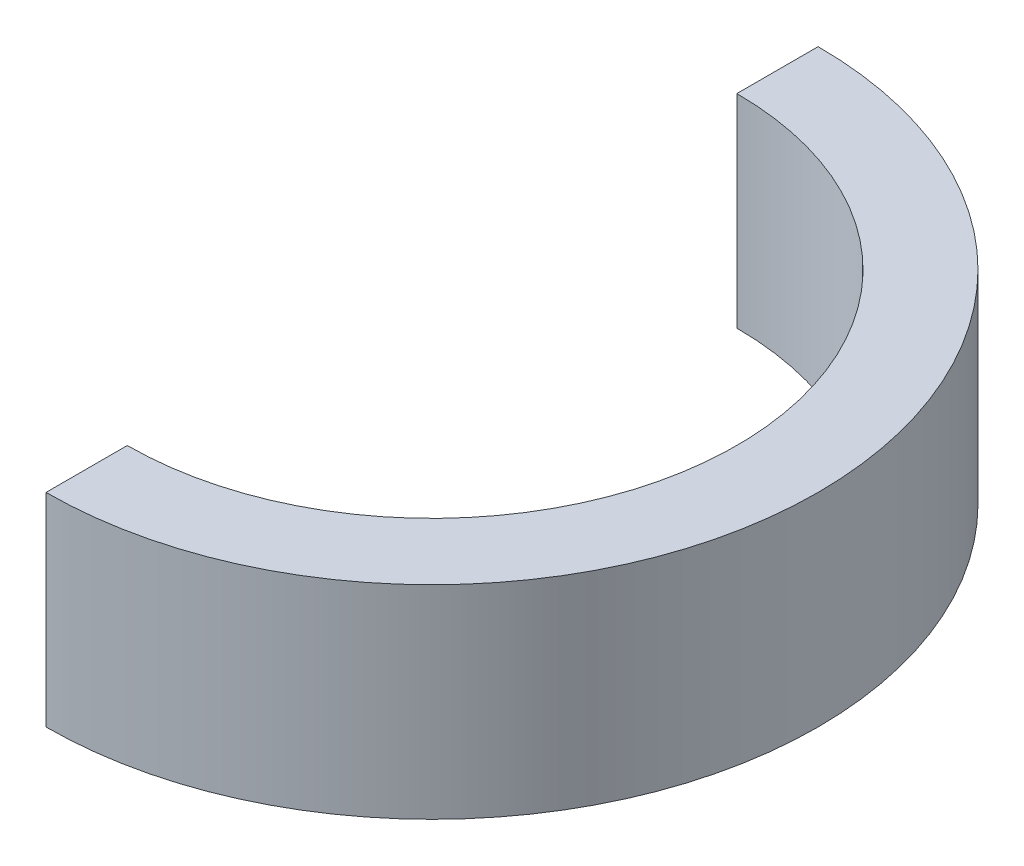
ISO-10303-21;
HEADER;
FILE_DESCRIPTION(('STEP AP214'),'2;1');
FILE_NAME('part.step','',(''),(''),'','','');
FILE_SCHEMA(('AUTOMOTIVE_DESIGN { 1 0 10303 214 1 1 1 1 }'));
ENDSEC;
DATA;
#1=APPLICATION_CONTEXT('core data for automotive mechanical design processes');
#2=APPLICATION_PROTOCOL_DEFINITION('international standard','automotive_design',2000,#1);
#3=PRODUCT_CONTEXT('',#1,'mechanical');
#4=PRODUCT('Part','Part','',(#3));
#5=PRODUCT_RELATED_PRODUCT_CATEGORY('part','',(#4));
#6=PRODUCT_DEFINITION_FORMATION('','',#4);
#7=PRODUCT_DEFINITION_CONTEXT('part definition',#1,'design');
#8=PRODUCT_DEFINITION('design','',#6,#7);
#9=PRODUCT_DEFINITION_SHAPE('','',#8);
#10=(LENGTH_UNIT() NAMED_UNIT(*) SI_UNIT(.MILLI.,.METRE.));
#11=(NAMED_UNIT(*) PLANE_ANGLE_UNIT() SI_UNIT($,.RADIAN.));
#12=(NAMED_UNIT(*) SI_UNIT($,.STERADIAN.) SOLID_ANGLE_UNIT());
#13=UNCERTAINTY_MEASURE_WITH_UNIT(LENGTH_MEASURE(1.E-05),#10,'distance_accuracy_value','');
#14=(GEOMETRIC_REPRESENTATION_CONTEXT(3) GLOBAL_UNCERTAINTY_ASSIGNED_CONTEXT((#13)) GLOBAL_UNIT_ASSIGNED_CONTEXT((#10,
#11,#12)) REPRESENTATION_CONTEXT('',''));
#15=CARTESIAN_POINT('',(0.,0.,0.));
#16=DIRECTION('',(0.,0.,1.));
#17=DIRECTION('',(1.,0.,0.));
#18=AXIS2_PLACEMENT_3D('',#15,#16,#17);
#19=CARTESIAN_POINT('',(0.,20.,0.));
#20=DIRECTION('',(0.,-1.,0.));
#21=DIRECTION('',(0.,0.,-1.));
#22=AXIS2_PLACEMENT_3D('',#19,#20,#21);
#23=CYLINDRICAL_SURFACE('',#22,30.);
#24=CARTESIAN_POINT('',(0.,0.,0.));
#25=DIRECTION('',(0.,-1.,0.));
#26=DIRECTION('',(0.,0.,1.));
#27=AXIS2_PLACEMENT_3D('',#24,#25,#26);
#28=CIRCLE('',#27,30.);
#29=CARTESIAN_POINT('',(0.,0.,-30.));
#30=VERTEX_POINT('',#29);
#31=CARTESIAN_POINT('',(0.,0.,30.));
#32=VERTEX_POINT('',#31);
#33=EDGE_CURVE('E101',#30,#32,#28,.T.);
#34=ORIENTED_EDGE('',*,*,#33,.T.);
#35=DIRECTION('',(0.,-1.,0.));
#36=VECTOR('',#35,1.);
#37=CARTESIAN_POINT('',(0.,20.,30.));
#38=LINE('',#37,#36);
#39=CARTESIAN_POINT('',(0.,20.,30.));
#40=VERTEX_POINT('',#39);
#41=EDGE_CURVE('E11',#40,#32,#38,.T.);
#42=ORIENTED_EDGE('',*,*,#41,.F.);
#43=CARTESIAN_POINT('',(0.,20.,0.));
#44=DIRECTION('',(0.,-1.,0.));
#45=DIRECTION('',(0.,0.,1.));
#46=AXIS2_PLACEMENT_3D('',#43,#44,#45);
#47=CIRCLE('',#46,30.);
#48=CARTESIAN_POINT('',(0.,20.,-30.));
#49=VERTEX_POINT('',#48);
#50=EDGE_CURVE('E89',#49,#40,#47,.T.);
#51=ORIENTED_EDGE('',*,*,#50,.F.);
#52=DIRECTION('',(0.,-1.,0.));
#53=VECTOR('',#52,1.);
#54=CARTESIAN_POINT('',(0.,20.,-30.));
#55=LINE('',#54,#53);
#56=EDGE_CURVE('E97',#49,#30,#55,.T.);
#57=ORIENTED_EDGE('',*,*,#56,.T.);
#58=EDGE_LOOP('',(#34,#42,#51,#57));
#59=FACE_BOUND('',#58,.T.);
#60=ADVANCED_FACE('F38',(#59),#23,.F.);
#61=CARTESIAN_POINT('',(0.,20.,30.));
#62=DIRECTION('',(1.,0.,0.));
#63=DIRECTION('',(0.,0.,-1.));
#64=AXIS2_PLACEMENT_3D('',#61,#62,#63);
#65=PLANE('',#64);
#66=DIRECTION('',(0.,0.,1.));
#67=VECTOR('',#66,1.);
#68=CARTESIAN_POINT('',(0.,0.,30.));
#69=LINE('',#68,#67);
#70=CARTESIAN_POINT('',(0.,0.,38.));
#71=VERTEX_POINT('',#70);
#72=EDGE_CURVE('E93',#32,#71,#69,.T.);
#73=ORIENTED_EDGE('',*,*,#72,.T.);
#74=DIRECTION('',(0.,-1.,0.));
#75=VECTOR('',#74,1.);
#76=CARTESIAN_POINT('',(0.,20.,38.));
#77=LINE('',#76,#75);
#78=CARTESIAN_POINT('',(0.,20.,38.));
#79=VERTEX_POINT('',#78);
#80=EDGE_CURVE('E46',#79,#71,#77,.T.);
#81=ORIENTED_EDGE('',*,*,#80,.F.);
#82=DIRECTION('',(0.,0.,1.));
#83=VECTOR('',#82,1.);
#84=CARTESIAN_POINT('',(0.,20.,30.));
#85=LINE('',#84,#83);
#86=EDGE_CURVE('E84',#40,#79,#85,.T.);
#87=ORIENTED_EDGE('',*,*,#86,.F.);
#88=ORIENTED_EDGE('',*,*,#41,.T.);
#89=EDGE_LOOP('',(#73,#81,#87,#88));
#90=FACE_BOUND('',#89,.T.);
#91=ADVANCED_FACE('F92',(#90),#65,.F.);
#92=CARTESIAN_POINT('',(0.,20.,0.));
#93=DIRECTION('',(0.,-1.,0.));
#94=DIRECTION('',(0.,0.,-1.));
#95=AXIS2_PLACEMENT_3D('',#92,#93,#94);
#96=CYLINDRICAL_SURFACE('',#95,38.);
#97=CARTESIAN_POINT('',(0.,0.,0.));
#98=DIRECTION('',(0.,1.,0.));
#99=DIRECTION('',(0.,0.,1.));
#100=AXIS2_PLACEMENT_3D('',#97,#98,#99);
#101=CIRCLE('',#100,38.);
#102=CARTESIAN_POINT('',(0.,0.,-38.));
#103=VERTEX_POINT('',#102);
#104=EDGE_CURVE('E71',#71,#103,#101,.T.);
#105=ORIENTED_EDGE('',*,*,#104,.T.);
#106=DIRECTION('',(0.,-1.,0.));
#107=VECTOR('',#106,1.);
#108=CARTESIAN_POINT('',(0.,20.,-38.));
#109=LINE('',#108,#107);
#110=CARTESIAN_POINT('',(0.,20.,-38.));
#111=VERTEX_POINT('',#110);
#112=EDGE_CURVE('E94',#111,#103,#109,.T.);
#113=ORIENTED_EDGE('',*,*,#112,.F.);
#114=CARTESIAN_POINT('',(0.,20.,0.));
#115=DIRECTION('',(0.,1.,0.));
#116=DIRECTION('',(0.,0.,1.));
#117=AXIS2_PLACEMENT_3D('',#114,#115,#116);
#118=CIRCLE('',#117,38.);
#119=EDGE_CURVE('E87',#79,#111,#118,.T.);
#120=ORIENTED_EDGE('',*,*,#119,.F.);
#121=ORIENTED_EDGE('',*,*,#80,.T.);
#122=EDGE_LOOP('',(#105,#113,#120,#121));
#123=FACE_BOUND('',#122,.T.);
#124=ADVANCED_FACE('F95',(#123),#96,.T.);
#125=CARTESIAN_POINT('',(0.,20.,-38.));
#126=DIRECTION('',(1.,0.,0.));
#127=DIRECTION('',(0.,0.,-1.));
#128=AXIS2_PLACEMENT_3D('',#125,#126,#127);
#129=PLANE('',#128);
#130=DIRECTION('',(0.,0.,1.));
#131=VECTOR('',#130,1.);
#132=CARTESIAN_POINT('',(0.,0.,-38.));
#133=LINE('',#132,#131);
#134=EDGE_CURVE('E77',#103,#30,#133,.T.);
#135=ORIENTED_EDGE('',*,*,#134,.T.);
#136=ORIENTED_EDGE('',*,*,#56,.F.);
#137=DIRECTION('',(0.,0.,1.));
#138=VECTOR('',#137,1.);
#139=CARTESIAN_POINT('',(0.,20.,-38.));
#140=LINE('',#139,#138);
#141=EDGE_CURVE('E54',#111,#49,#140,.T.);
#142=ORIENTED_EDGE('',*,*,#141,.F.);
#143=ORIENTED_EDGE('',*,*,#112,.T.);
#144=EDGE_LOOP('',(#135,#136,#142,#143));
#145=FACE_BOUND('',#144,.T.);
#146=ADVANCED_FACE('F108',(#145),#129,.F.);
#147=CARTESIAN_POINT('',(0.,20.,0.));
#148=DIRECTION('',(0.,1.,0.));
#149=DIRECTION('',(0.,0.,1.));
#150=AXIS2_PLACEMENT_3D('',#147,#148,#149);
#151=PLANE('',#150);
#152=ORIENTED_EDGE('',*,*,#50,.T.);
#153=ORIENTED_EDGE('',*,*,#86,.T.);
#154=ORIENTED_EDGE('',*,*,#119,.T.);
#155=ORIENTED_EDGE('',*,*,#141,.T.);
#156=EDGE_LOOP('',(#152,#153,#154,#155));
#157=FACE_BOUND('',#156,.T.);
#158=ADVANCED_FACE('F85',(#157),#151,.T.);
#159=CARTESIAN_POINT('',(0.,0.,0.));
#160=DIRECTION('',(0.,1.,0.));
#161=DIRECTION('',(0.,0.,1.));
#162=AXIS2_PLACEMENT_3D('',#159,#160,#161);
#163=PLANE('',#162);
#164=ORIENTED_EDGE('',*,*,#33,.F.);
#165=ORIENTED_EDGE('',*,*,#134,.F.);
#166=ORIENTED_EDGE('',*,*,#104,.F.);
#167=ORIENTED_EDGE('',*,*,#72,.F.);
#168=EDGE_LOOP('',(#164,#165,#166,#167));
#169=FACE_BOUND('',#168,.T.);
#170=ADVANCED_FACE('F111',(#169),#163,.F.);
#171=CLOSED_SHELL('',(#60,#91,#124,#146,#158,#170));
#172=MANIFOLD_SOLID_BREP('B2',#171);
#173=ADVANCED_BREP_SHAPE_REPRESENTATION('',(#18,#172),#14);
#174=SHAPE_DEFINITION_REPRESENTATION(#9,#173);
ENDSEC;
END-ISO-10303-21;
